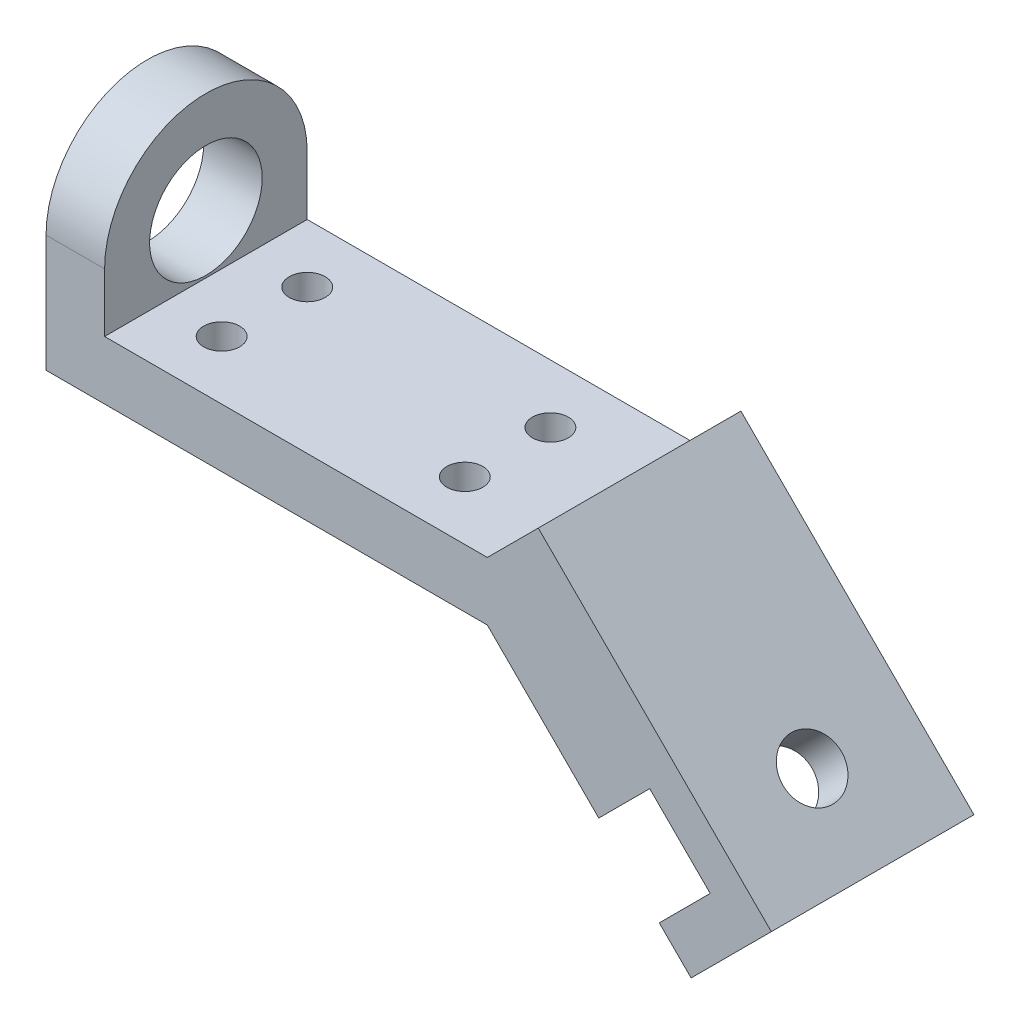
ISO-10303-21;
HEADER;
FILE_DESCRIPTION(('STEP AP214'),'2;1');
FILE_NAME('part.step','',(''),(''),'','','');
FILE_SCHEMA(('AUTOMOTIVE_DESIGN { 1 0 10303 214 1 1 1 1 }'));
ENDSEC;
DATA;
#1=APPLICATION_CONTEXT('core data for automotive mechanical design processes');
#2=APPLICATION_PROTOCOL_DEFINITION('international standard','automotive_design',2000,#1);
#3=PRODUCT_CONTEXT('',#1,'mechanical');
#4=PRODUCT('Part','Part','',(#3));
#5=PRODUCT_RELATED_PRODUCT_CATEGORY('part','',(#4));
#6=PRODUCT_DEFINITION_FORMATION('','',#4);
#7=PRODUCT_DEFINITION_CONTEXT('part definition',#1,'design');
#8=PRODUCT_DEFINITION('design','',#6,#7);
#9=PRODUCT_DEFINITION_SHAPE('','',#8);
#10=(LENGTH_UNIT() NAMED_UNIT(*) SI_UNIT(.MILLI.,.METRE.));
#11=(NAMED_UNIT(*) PLANE_ANGLE_UNIT() SI_UNIT($,.RADIAN.));
#12=(NAMED_UNIT(*) SI_UNIT($,.STERADIAN.) SOLID_ANGLE_UNIT());
#13=UNCERTAINTY_MEASURE_WITH_UNIT(LENGTH_MEASURE(1.E-05),#10,'distance_accuracy_value','');
#14=(GEOMETRIC_REPRESENTATION_CONTEXT(3) GLOBAL_UNCERTAINTY_ASSIGNED_CONTEXT((#13)) GLOBAL_UNIT_ASSIGNED_CONTEXT((#10,
#11,#12)) REPRESENTATION_CONTEXT('',''));
#15=CARTESIAN_POINT('',(0.,0.,0.));
#16=DIRECTION('',(0.,0.,1.));
#17=DIRECTION('',(1.,0.,0.));
#18=AXIS2_PLACEMENT_3D('',#15,#16,#17);
#19=CARTESIAN_POINT('',(49.,0.,22.5));
#20=DIRECTION('',(0.707106781186549,0.707106781186546,0.));
#21=DIRECTION('',(-0.707106781186546,0.707106781186549,0.));
#22=AXIS2_PLACEMENT_3D('',#19,#20,#21);
#23=PLANE('',#22);
#24=DIRECTION('',(0.707106781186546,-0.707106781186549,0.));
#25=VECTOR('',#24,1.);
#26=CARTESIAN_POINT('',(49.,0.,-22.5));
#27=LINE('',#26,#25);
#28=CARTESIAN_POINT('',(49.,0.,-22.5));
#29=VERTEX_POINT('',#28);
#30=CARTESIAN_POINT('',(73.7487373415292,-24.7487373415292,-22.5));
#31=VERTEX_POINT('',#30);
#32=EDGE_CURVE('E168',#29,#31,#27,.T.);
#33=ORIENTED_EDGE('',*,*,#32,.T.);
#34=DIRECTION('',(0.,0.,1.));
#35=VECTOR('',#34,1.);
#36=CARTESIAN_POINT('',(73.7487373415292,-24.7487373415292,-22.5));
#37=LINE('',#36,#35);
#38=CARTESIAN_POINT('',(73.7487373415292,-24.7487373415292,22.5));
#39=VERTEX_POINT('',#38);
#40=EDGE_CURVE('E225',#31,#39,#37,.T.);
#41=ORIENTED_EDGE('',*,*,#40,.T.);
#42=DIRECTION('',(0.707106781186546,-0.707106781186549,0.));
#43=VECTOR('',#42,1.);
#44=CARTESIAN_POINT('',(49.,0.,22.5));
#45=LINE('',#44,#43);
#46=CARTESIAN_POINT('',(49.,0.,22.5));
#47=VERTEX_POINT('',#46);
#48=EDGE_CURVE('E273',#47,#39,#45,.T.);
#49=ORIENTED_EDGE('',*,*,#48,.F.);
#50=DIRECTION('',(0.,0.,-1.));
#51=VECTOR('',#50,1.);
#52=CARTESIAN_POINT('',(49.,0.,22.5));
#53=LINE('',#52,#51);
#54=EDGE_CURVE('E11',#47,#29,#53,.T.);
#55=ORIENTED_EDGE('',*,*,#54,.T.);
#56=EDGE_LOOP('',(#33,#41,#49,#55));
#57=FACE_BOUND('',#56,.T.);
#58=ADVANCED_FACE('F39',(#57),#23,.F.);
#59=CARTESIAN_POINT('',(49.,13.,22.5));
#60=DIRECTION('',(0.,-1.,0.));
#61=DIRECTION('',(1.,0.,0.));
#62=AXIS2_PLACEMENT_3D('',#59,#60,#61);
#63=PLANE('',#62);
#64=CARTESIAN_POINT('',(-23.,13.,9.5));
#65=DIRECTION('',(0.,-1.,0.));
#66=DIRECTION('',(-1.,0.,0.));
#67=AXIS2_PLACEMENT_3D('',#64,#65,#66);
#68=CIRCLE('',#67,4.);
#69=CARTESIAN_POINT('',(-27.,13.,9.5));
#70=VERTEX_POINT('',#69);
#71=EDGE_CURVE('E200',#70,#70,#68,.T.);
#72=ORIENTED_EDGE('',*,*,#71,.T.);
#73=EDGE_LOOP('',(#72));
#74=FACE_BOUND('',#73,.T.);
#75=CARTESIAN_POINT('',(31.,13.,9.5));
#76=DIRECTION('',(0.,-1.,0.));
#77=DIRECTION('',(-1.,0.,0.));
#78=AXIS2_PLACEMENT_3D('',#75,#76,#77);
#79=CIRCLE('',#78,4.);
#80=CARTESIAN_POINT('',(27.,13.,9.5));
#81=VERTEX_POINT('',#80);
#82=EDGE_CURVE('E206',#81,#81,#79,.T.);
#83=ORIENTED_EDGE('',*,*,#82,.T.);
#84=EDGE_LOOP('',(#83));
#85=FACE_BOUND('',#84,.T.);
#86=CARTESIAN_POINT('',(-23.,13.,-9.5));
#87=DIRECTION('',(0.,1.,0.));
#88=DIRECTION('',(-1.,0.,0.));
#89=AXIS2_PLACEMENT_3D('',#86,#87,#88);
#90=CIRCLE('',#89,4.);
#91=CARTESIAN_POINT('',(-27.,13.,-9.5));
#92=VERTEX_POINT('',#91);
#93=EDGE_CURVE('E196',#92,#92,#90,.T.);
#94=ORIENTED_EDGE('',*,*,#93,.F.);
#95=EDGE_LOOP('',(#94));
#96=FACE_BOUND('',#95,.T.);
#97=CARTESIAN_POINT('',(31.,13.,-9.5));
#98=DIRECTION('',(0.,1.,0.));
#99=DIRECTION('',(-1.,0.,0.));
#100=AXIS2_PLACEMENT_3D('',#97,#98,#99);
#101=CIRCLE('',#100,4.);
#102=CARTESIAN_POINT('',(27.,13.,-9.5));
#103=VERTEX_POINT('',#102);
#104=EDGE_CURVE('E204',#103,#103,#101,.T.);
#105=ORIENTED_EDGE('',*,*,#104,.F.);
#106=EDGE_LOOP('',(#105));
#107=FACE_BOUND('',#106,.T.);
#108=DIRECTION('',(0.,0.,-1.));
#109=VECTOR('',#108,1.);
#110=CARTESIAN_POINT('',(-36.,13.,22.5));
#111=LINE('',#110,#109);
#112=CARTESIAN_POINT('',(-36.,13.,22.5));
#113=VERTEX_POINT('',#112);
#114=CARTESIAN_POINT('',(-36.,13.,-22.5));
#115=VERTEX_POINT('',#114);
#116=EDGE_CURVE('E254',#113,#115,#111,.T.);
#117=ORIENTED_EDGE('',*,*,#116,.F.);
#118=DIRECTION('',(-1.,0.,0.));
#119=VECTOR('',#118,1.);
#120=CARTESIAN_POINT('',(49.,13.,22.5));
#121=LINE('',#120,#119);
#122=CARTESIAN_POINT('',(49.,13.,22.5));
#123=VERTEX_POINT('',#122);
#124=EDGE_CURVE('E277',#123,#113,#121,.T.);
#125=ORIENTED_EDGE('',*,*,#124,.F.);
#126=DIRECTION('',(0.,0.,-1.));
#127=VECTOR('',#126,1.);
#128=CARTESIAN_POINT('',(49.,13.,22.5));
#129=LINE('',#128,#127);
#130=CARTESIAN_POINT('',(49.,13.,-22.5));
#131=VERTEX_POINT('',#130);
#132=EDGE_CURVE('E183',#123,#131,#129,.T.);
#133=ORIENTED_EDGE('',*,*,#132,.T.);
#134=DIRECTION('',(-1.,0.,0.));
#135=VECTOR('',#134,1.);
#136=CARTESIAN_POINT('',(49.,13.,-22.5));
#137=LINE('',#136,#135);
#138=EDGE_CURVE('E177',#131,#115,#137,.T.);
#139=ORIENTED_EDGE('',*,*,#138,.T.);
#140=EDGE_LOOP('',(#117,#125,#133,#139));
#141=FACE_BOUND('',#140,.T.);
#142=ADVANCED_FACE('F286',(#74,#85,#96,#107,#141),#63,.F.);
#143=CARTESIAN_POINT('',(-49.,0.,22.5));
#144=DIRECTION('',(0.,1.,0.));
#145=DIRECTION('',(-1.,0.,0.));
#146=AXIS2_PLACEMENT_3D('',#143,#144,#145);
#147=PLANE('',#146);
#148=CARTESIAN_POINT('',(-23.,0.,9.5));
#149=DIRECTION('',(0.,1.,0.));
#150=DIRECTION('',(-1.,0.,0.));
#151=AXIS2_PLACEMENT_3D('',#148,#149,#150);
#152=CIRCLE('',#151,4.);
#153=CARTESIAN_POINT('',(-27.,0.,9.5));
#154=VERTEX_POINT('',#153);
#155=EDGE_CURVE('E43',#154,#154,#152,.F.);
#156=ORIENTED_EDGE('',*,*,#155,.F.);
#157=EDGE_LOOP('',(#156));
#158=FACE_BOUND('',#157,.T.);
#159=CARTESIAN_POINT('',(31.,0.,9.5));
#160=DIRECTION('',(0.,1.,0.));
#161=DIRECTION('',(-1.,0.,0.));
#162=AXIS2_PLACEMENT_3D('',#159,#160,#161);
#163=CIRCLE('',#162,4.);
#164=CARTESIAN_POINT('',(27.,0.,9.5));
#165=VERTEX_POINT('',#164);
#166=EDGE_CURVE('E198',#165,#165,#163,.F.);
#167=ORIENTED_EDGE('',*,*,#166,.F.);
#168=EDGE_LOOP('',(#167));
#169=FACE_BOUND('',#168,.T.);
#170=CARTESIAN_POINT('',(-23.,0.,-9.5));
#171=DIRECTION('',(0.,1.,0.));
#172=DIRECTION('',(-1.,0.,0.));
#173=AXIS2_PLACEMENT_3D('',#170,#171,#172);
#174=CIRCLE('',#173,4.);
#175=CARTESIAN_POINT('',(-27.,0.,-9.5));
#176=VERTEX_POINT('',#175);
#177=EDGE_CURVE('E195',#176,#176,#174,.T.);
#178=ORIENTED_EDGE('',*,*,#177,.T.);
#179=EDGE_LOOP('',(#178));
#180=FACE_BOUND('',#179,.T.);
#181=CARTESIAN_POINT('',(31.,0.,-9.5));
#182=DIRECTION('',(0.,1.,0.));
#183=DIRECTION('',(-1.,0.,0.));
#184=AXIS2_PLACEMENT_3D('',#181,#182,#183);
#185=CIRCLE('',#184,4.);
#186=CARTESIAN_POINT('',(27.,0.,-9.5));
#187=VERTEX_POINT('',#186);
#188=EDGE_CURVE('E192',#187,#187,#185,.T.);
#189=ORIENTED_EDGE('',*,*,#188,.T.);
#190=EDGE_LOOP('',(#189));
#191=FACE_BOUND('',#190,.T.);
#192=DIRECTION('',(1.,0.,0.));
#193=VECTOR('',#192,1.);
#194=CARTESIAN_POINT('',(-49.,0.,-22.5));
#195=LINE('',#194,#193);
#196=CARTESIAN_POINT('',(-49.,0.,-22.5));
#197=VERTEX_POINT('',#196);
#198=EDGE_CURVE('E169',#197,#29,#195,.T.);
#199=ORIENTED_EDGE('',*,*,#198,.T.);
#200=ORIENTED_EDGE('',*,*,#54,.F.);
#201=DIRECTION('',(1.,0.,0.));
#202=VECTOR('',#201,1.);
#203=CARTESIAN_POINT('',(-49.,0.,22.5));
#204=LINE('',#203,#202);
#205=CARTESIAN_POINT('',(-49.,0.,22.5));
#206=VERTEX_POINT('',#205);
#207=EDGE_CURVE('E89',#206,#47,#204,.T.);
#208=ORIENTED_EDGE('',*,*,#207,.F.);
#209=DIRECTION('',(0.,0.,-1.));
#210=VECTOR('',#209,1.);
#211=CARTESIAN_POINT('',(-49.,0.,22.5));
#212=LINE('',#211,#210);
#213=EDGE_CURVE('E181',#206,#197,#212,.T.);
#214=ORIENTED_EDGE('',*,*,#213,.T.);
#215=EDGE_LOOP('',(#199,#200,#208,#214));
#216=FACE_BOUND('',#215,.T.);
#217=ADVANCED_FACE('F41',(#158,#169,#180,#191,#216),#147,.F.);
#218=CARTESIAN_POINT('',(87.1837661840736,-38.1837661840736,22.5));
#219=VERTEX_POINT('',#218);
#220=CARTESIAN_POINT('',(94.254833995939,-45.2548339959391,22.5));
#221=VERTEX_POINT('',#220);
#222=EDGE_CURVE('E160',#219,#221,#45,.T.);
#223=ORIENTED_EDGE('',*,*,#222,.F.);
#224=DIRECTION('',(0.,0.,1.));
#225=VECTOR('',#224,1.);
#226=CARTESIAN_POINT('',(87.1837661840736,-38.1837661840736,-22.5));
#227=LINE('',#226,#225);
#228=CARTESIAN_POINT('',(87.1837661840736,-38.1837661840736,-22.5));
#229=VERTEX_POINT('',#228);
#230=EDGE_CURVE('E147',#229,#219,#227,.T.);
#231=ORIENTED_EDGE('',*,*,#230,.F.);
#232=CARTESIAN_POINT('',(94.254833995939,-45.2548339959391,-22.5));
#233=VERTEX_POINT('',#232);
#234=EDGE_CURVE('E158',#229,#233,#27,.T.);
#235=ORIENTED_EDGE('',*,*,#234,.T.);
#236=DIRECTION('',(0.,0.,-1.));
#237=VECTOR('',#236,1.);
#238=CARTESIAN_POINT('',(94.254833995939,-45.2548339959391,22.5));
#239=LINE('',#238,#237);
#240=EDGE_CURVE('E48',#221,#233,#239,.T.);
#241=ORIENTED_EDGE('',*,*,#240,.F.);
#242=EDGE_LOOP('',(#223,#231,#235,#241));
#243=FACE_BOUND('',#242,.T.);
#244=ADVANCED_FACE('F156',(#243),#23,.F.);
#245=CARTESIAN_POINT('',(94.254833995939,-45.2548339959391,22.5));
#246=DIRECTION('',(-0.707106781186546,0.707106781186549,0.));
#247=DIRECTION('',(-0.707106781186549,-0.707106781186546,0.));
#248=AXIS2_PLACEMENT_3D('',#245,#246,#247);
#249=PLANE('',#248);
#250=DIRECTION('',(0.707106781186549,0.707106781186546,0.));
#251=VECTOR('',#250,1.);
#252=CARTESIAN_POINT('',(94.254833995939,-45.2548339959391,-22.5));
#253=LINE('',#252,#251);
#254=CARTESIAN_POINT('',(112.068542494924,-27.4411254969544,-22.5));
#255=VERTEX_POINT('',#254);
#256=EDGE_CURVE('E167',#233,#255,#253,.T.);
#257=ORIENTED_EDGE('',*,*,#256,.T.);
#258=DIRECTION('',(0.,0.,-1.));
#259=VECTOR('',#258,1.);
#260=CARTESIAN_POINT('',(112.068542494924,-27.4411254969544,-22.5));
#261=LINE('',#260,#259);
#262=CARTESIAN_POINT('',(112.068542494924,-27.4411254969544,22.5));
#263=VERTEX_POINT('',#262);
#264=EDGE_CURVE('E260',#263,#255,#261,.T.);
#265=ORIENTED_EDGE('',*,*,#264,.F.);
#266=DIRECTION('',(0.707106781186549,0.707106781186546,0.));
#267=VECTOR('',#266,1.);
#268=CARTESIAN_POINT('',(94.254833995939,-45.2548339959391,22.5));
#269=LINE('',#268,#267);
#270=EDGE_CURVE('E275',#221,#263,#269,.T.);
#271=ORIENTED_EDGE('',*,*,#270,.F.);
#272=ORIENTED_EDGE('',*,*,#240,.T.);
#273=EDGE_LOOP('',(#257,#265,#271,#272));
#274=FACE_BOUND('',#273,.T.);
#275=ADVANCED_FACE('F328',(#274),#249,.F.);
#276=CARTESIAN_POINT('',(-49.,13.,22.5));
#277=DIRECTION('',(1.,0.,0.));
#278=DIRECTION('',(0.,0.,-1.));
#279=AXIS2_PLACEMENT_3D('',#276,#277,#278);
#280=PLANE('',#279);
#281=CARTESIAN_POINT('',(-49.,26.,0.));
#282=DIRECTION('',(1.,0.,0.));
#283=DIRECTION('',(0.,0.,-1.));
#284=AXIS2_PLACEMENT_3D('',#281,#282,#283);
#285=CIRCLE('',#284,12.5);
#286=CARTESIAN_POINT('',(-49.,26.,-12.5));
#287=VERTEX_POINT('',#286);
#288=EDGE_CURVE('E152',#287,#287,#285,.T.);
#289=ORIENTED_EDGE('',*,*,#288,.T.);
#290=EDGE_LOOP('',(#289));
#291=FACE_BOUND('',#290,.T.);
#292=DIRECTION('',(0.,-1.,0.));
#293=VECTOR('',#292,1.);
#294=CARTESIAN_POINT('',(-49.,13.,-22.5));
#295=LINE('',#294,#293);
#296=CARTESIAN_POINT('',(-49.,26.,-22.5));
#297=VERTEX_POINT('',#296);
#298=EDGE_CURVE('E84',#297,#197,#295,.T.);
#299=ORIENTED_EDGE('',*,*,#298,.T.);
#300=ORIENTED_EDGE('',*,*,#213,.F.);
#301=DIRECTION('',(0.,-1.,0.));
#302=VECTOR('',#301,1.);
#303=CARTESIAN_POINT('',(-49.,13.,22.5));
#304=LINE('',#303,#302);
#305=CARTESIAN_POINT('',(-49.,26.,22.5));
#306=VERTEX_POINT('',#305);
#307=EDGE_CURVE('E65',#306,#206,#304,.T.);
#308=ORIENTED_EDGE('',*,*,#307,.F.);
#309=CARTESIAN_POINT('',(-49.,26.,0.));
#310=DIRECTION('',(-1.,0.,0.));
#311=DIRECTION('',(0.,0.,1.));
#312=AXIS2_PLACEMENT_3D('',#309,#310,#311);
#313=CIRCLE('',#312,22.5);
#314=EDGE_CURVE('E240',#306,#297,#313,.T.);
#315=ORIENTED_EDGE('',*,*,#314,.T.);
#316=EDGE_LOOP('',(#299,#300,#308,#315));
#317=FACE_BOUND('',#316,.T.);
#318=ADVANCED_FACE('F298',(#291,#317),#280,.F.);
#319=CARTESIAN_POINT('',(0.,0.,22.5));
#320=DIRECTION('',(0.,0.,-1.));
#321=DIRECTION('',(-1.,0.,0.));
#322=AXIS2_PLACEMENT_3D('',#319,#320,#321);
#323=PLANE('',#322);
#324=ORIENTED_EDGE('',*,*,#48,.T.);
#325=DIRECTION('',(0.707106781186547,0.707106781186548,0.));
#326=VECTOR('',#325,1.);
#327=CARTESIAN_POINT('',(49.2487373415292,-49.2487373415292,22.5));
#328=LINE('',#327,#326);
#329=CARTESIAN_POINT('',(85.0624458405139,-13.4350288425444,22.5));
#330=VERTEX_POINT('',#329);
#331=EDGE_CURVE('E237',#39,#330,#328,.T.);
#332=ORIENTED_EDGE('',*,*,#331,.T.);
#333=DIRECTION('',(0.707106781186548,-0.707106781186547,0.));
#334=VECTOR('',#333,1.);
#335=CARTESIAN_POINT('',(35.8137084989848,35.8137084989848,22.5));
#336=LINE('',#335,#334);
#337=CARTESIAN_POINT('',(98.4974746830583,-26.8700576850888,22.5));
#338=VERTEX_POINT('',#337);
#339=EDGE_CURVE('E234',#330,#338,#336,.T.);
#340=ORIENTED_EDGE('',*,*,#339,.T.);
#341=DIRECTION('',(-0.707106781186547,-0.707106781186548,0.));
#342=VECTOR('',#341,1.);
#343=CARTESIAN_POINT('',(62.6837661840736,-62.6837661840735,22.5));
#344=LINE('',#343,#342);
#345=EDGE_CURVE('E228',#338,#219,#344,.T.);
#346=ORIENTED_EDGE('',*,*,#345,.T.);
#347=ORIENTED_EDGE('',*,*,#222,.T.);
#348=ORIENTED_EDGE('',*,*,#270,.T.);
#349=DIRECTION('',(0.707106781186547,-0.707106781186548,0.));
#350=VECTOR('',#349,1.);
#351=CARTESIAN_POINT('',(112.068542494924,-27.4411254969544,22.5));
#352=LINE('',#351,#350);
#353=CARTESIAN_POINT('',(60.3137084989848,24.3137084989847,22.5));
#354=VERTEX_POINT('',#353);
#355=EDGE_CURVE('E257',#354,#263,#352,.T.);
#356=ORIENTED_EDGE('',*,*,#355,.F.);
#357=DIRECTION('',(-0.707106781186548,-0.707106781186547,0.));
#358=VECTOR('',#357,1.);
#359=CARTESIAN_POINT('',(60.3137084989848,24.3137084989847,22.5));
#360=LINE('',#359,#358);
#361=EDGE_CURVE('E267',#354,#123,#360,.T.);
#362=ORIENTED_EDGE('',*,*,#361,.T.);
#363=ORIENTED_EDGE('',*,*,#124,.T.);
#364=DIRECTION('',(0.,1.,0.));
#365=VECTOR('',#364,1.);
#366=CARTESIAN_POINT('',(-36.,0.,22.5));
#367=LINE('',#366,#365);
#368=CARTESIAN_POINT('',(-36.,26.,22.5));
#369=VERTEX_POINT('',#368);
#370=EDGE_CURVE('E241',#113,#369,#367,.T.);
#371=ORIENTED_EDGE('',*,*,#370,.T.);
#372=DIRECTION('',(-1.,0.,0.));
#373=VECTOR('',#372,1.);
#374=CARTESIAN_POINT('',(-36.,26.,22.5));
#375=LINE('',#374,#373);
#376=EDGE_CURVE('E249',#369,#306,#375,.T.);
#377=ORIENTED_EDGE('',*,*,#376,.T.);
#378=ORIENTED_EDGE('',*,*,#307,.T.);
#379=ORIENTED_EDGE('',*,*,#207,.T.);
#380=EDGE_LOOP('',(#324,#332,#340,#346,#347,#348,#356,#362,#363,#371,#377,#378,#379));
#381=FACE_BOUND('',#380,.T.);
#382=ADVANCED_FACE('F279',(#381),#323,.F.);
#383=CARTESIAN_POINT('',(0.,0.,-22.5));
#384=DIRECTION('',(0.,0.,-1.));
#385=DIRECTION('',(-1.,0.,0.));
#386=AXIS2_PLACEMENT_3D('',#383,#384,#385);
#387=PLANE('',#386);
#388=DIRECTION('',(-0.707106781186547,-0.707106781186548,0.));
#389=VECTOR('',#388,1.);
#390=CARTESIAN_POINT('',(73.7487373415292,-24.7487373415292,-22.5));
#391=LINE('',#390,#389);
#392=CARTESIAN_POINT('',(85.0624458405139,-13.4350288425444,-22.5));
#393=VERTEX_POINT('',#392);
#394=EDGE_CURVE('E161',#393,#31,#391,.T.);
#395=ORIENTED_EDGE('',*,*,#394,.T.);
#396=ORIENTED_EDGE('',*,*,#32,.F.);
#397=ORIENTED_EDGE('',*,*,#198,.F.);
#398=ORIENTED_EDGE('',*,*,#298,.F.);
#399=DIRECTION('',(-1.,0.,0.));
#400=VECTOR('',#399,1.);
#401=CARTESIAN_POINT('',(-36.,26.,-22.5));
#402=LINE('',#401,#400);
#403=CARTESIAN_POINT('',(-36.,26.,-22.5));
#404=VERTEX_POINT('',#403);
#405=EDGE_CURVE('E251',#404,#297,#402,.T.);
#406=ORIENTED_EDGE('',*,*,#405,.F.);
#407=DIRECTION('',(0.,-1.,0.));
#408=VECTOR('',#407,1.);
#409=CARTESIAN_POINT('',(-36.,0.,-22.5));
#410=LINE('',#409,#408);
#411=EDGE_CURVE('E246',#404,#115,#410,.T.);
#412=ORIENTED_EDGE('',*,*,#411,.T.);
#413=ORIENTED_EDGE('',*,*,#138,.F.);
#414=DIRECTION('',(-0.707106781186548,-0.707106781186547,0.));
#415=VECTOR('',#414,1.);
#416=CARTESIAN_POINT('',(60.3137084989848,24.3137084989847,-22.5));
#417=LINE('',#416,#415);
#418=CARTESIAN_POINT('',(60.3137084989848,24.3137084989847,-22.5));
#419=VERTEX_POINT('',#418);
#420=EDGE_CURVE('E172',#419,#131,#417,.T.);
#421=ORIENTED_EDGE('',*,*,#420,.F.);
#422=DIRECTION('',(-0.707106781186547,0.707106781186548,0.));
#423=VECTOR('',#422,1.);
#424=CARTESIAN_POINT('',(60.3137084989848,24.3137084989847,-22.5));
#425=LINE('',#424,#423);
#426=EDGE_CURVE('E263',#255,#419,#425,.T.);
#427=ORIENTED_EDGE('',*,*,#426,.F.);
#428=ORIENTED_EDGE('',*,*,#256,.F.);
#429=ORIENTED_EDGE('',*,*,#234,.F.);
#430=DIRECTION('',(0.707106781186547,0.707106781186548,0.));
#431=VECTOR('',#430,1.);
#432=CARTESIAN_POINT('',(98.4974746830583,-26.8700576850888,-22.5));
#433=LINE('',#432,#431);
#434=CARTESIAN_POINT('',(98.4974746830583,-26.8700576850888,-22.5));
#435=VERTEX_POINT('',#434);
#436=EDGE_CURVE('E144',#229,#435,#433,.T.);
#437=ORIENTED_EDGE('',*,*,#436,.T.);
#438=DIRECTION('',(-0.707106781186548,0.707106781186547,0.));
#439=VECTOR('',#438,1.);
#440=CARTESIAN_POINT('',(85.0624458405139,-13.4350288425444,-22.5));
#441=LINE('',#440,#439);
#442=EDGE_CURVE('E56',#435,#393,#441,.T.);
#443=ORIENTED_EDGE('',*,*,#442,.T.);
#444=EDGE_LOOP('',(#395,#396,#397,#398,#406,#412,#413,#421,#427,#428,#429,#437,#443));
#445=FACE_BOUND('',#444,.T.);
#446=ADVANCED_FACE('F165',(#445),#387,.T.);
#447=CARTESIAN_POINT('',(60.3137084989848,24.3137084989847,22.5));
#448=DIRECTION('',(0.707106781186547,-0.707106781186548,0.));
#449=DIRECTION('',(0.707106781186548,0.707106781186547,0.));
#450=AXIS2_PLACEMENT_3D('',#447,#448,#449);
#451=PLANE('',#450);
#452=ORIENTED_EDGE('',*,*,#132,.F.);
#453=ORIENTED_EDGE('',*,*,#361,.F.);
#454=DIRECTION('',(0.,0.,1.));
#455=VECTOR('',#454,1.);
#456=CARTESIAN_POINT('',(60.3137084989848,24.3137084989847,22.5));
#457=LINE('',#456,#455);
#458=EDGE_CURVE('E265',#419,#354,#457,.T.);
#459=ORIENTED_EDGE('',*,*,#458,.F.);
#460=ORIENTED_EDGE('',*,*,#420,.T.);
#461=EDGE_LOOP('',(#452,#453,#459,#460));
#462=FACE_BOUND('',#461,.T.);
#463=ADVANCED_FACE('F288',(#462),#451,.F.);
#464=CARTESIAN_POINT('',(42.3137084989848,42.3137084989847,0.));
#465=DIRECTION('',(-0.707106781186548,-0.707106781186547,0.));
#466=DIRECTION('',(0.707106781186547,-0.707106781186548,0.));
#467=AXIS2_PLACEMENT_3D('',#464,#465,#466);
#468=PLANE('',#467);
#469=CARTESIAN_POINT('',(98.6335136523794,-14.00609665441,0.));
#470=DIRECTION('',(0.707106781186548,0.707106781186547,0.));
#471=DIRECTION('',(-0.707106781186547,0.707106781186548,0.));
#472=AXIS2_PLACEMENT_3D('',#469,#470,#471);
#473=CIRCLE('',#472,6.5);
#474=CARTESIAN_POINT('',(94.0373195746668,-9.40990257669739,0.));
#475=VERTEX_POINT('',#474);
#476=EDGE_CURVE('E191',#475,#475,#473,.T.);
#477=ORIENTED_EDGE('',*,*,#476,.F.);
#478=EDGE_LOOP('',(#477));
#479=FACE_BOUND('',#478,.T.);
#480=ORIENTED_EDGE('',*,*,#355,.T.);
#481=ORIENTED_EDGE('',*,*,#264,.T.);
#482=ORIENTED_EDGE('',*,*,#426,.T.);
#483=ORIENTED_EDGE('',*,*,#458,.T.);
#484=EDGE_LOOP('',(#480,#481,#482,#483));
#485=FACE_BOUND('',#484,.T.);
#486=ADVANCED_FACE('F372',(#479,#485),#468,.F.);
#487=CARTESIAN_POINT('',(-36.,26.,0.));
#488=DIRECTION('',(-1.,0.,0.));
#489=DIRECTION('',(0.,0.,1.));
#490=AXIS2_PLACEMENT_3D('',#487,#488,#489);
#491=PLANE('',#490);
#492=CARTESIAN_POINT('',(-36.,26.,0.));
#493=DIRECTION('',(1.,0.,0.));
#494=DIRECTION('',(0.,0.,-1.));
#495=AXIS2_PLACEMENT_3D('',#492,#493,#494);
#496=CIRCLE('',#495,12.5);
#497=CARTESIAN_POINT('',(-36.,26.,-12.5));
#498=VERTEX_POINT('',#497);
#499=EDGE_CURVE('E190',#498,#498,#496,.T.);
#500=ORIENTED_EDGE('',*,*,#499,.F.);
#501=EDGE_LOOP('',(#500));
#502=FACE_BOUND('',#501,.T.);
#503=ORIENTED_EDGE('',*,*,#370,.F.);
#504=ORIENTED_EDGE('',*,*,#116,.T.);
#505=ORIENTED_EDGE('',*,*,#411,.F.);
#506=CARTESIAN_POINT('',(-36.,26.,0.));
#507=DIRECTION('',(-1.,0.,0.));
#508=DIRECTION('',(0.,0.,1.));
#509=AXIS2_PLACEMENT_3D('',#506,#507,#508);
#510=CIRCLE('',#509,22.5);
#511=EDGE_CURVE('E243',#369,#404,#510,.T.);
#512=ORIENTED_EDGE('',*,*,#511,.F.);
#513=EDGE_LOOP('',(#503,#504,#505,#512));
#514=FACE_BOUND('',#513,.T.);
#515=ADVANCED_FACE('F294',(#502,#514),#491,.F.);
#516=CARTESIAN_POINT('',(-36.,26.,0.));
#517=DIRECTION('',(-1.,0.,0.));
#518=DIRECTION('',(0.,0.,1.));
#519=AXIS2_PLACEMENT_3D('',#516,#517,#518);
#520=CYLINDRICAL_SURFACE('',#519,22.5);
#521=ORIENTED_EDGE('',*,*,#314,.F.);
#522=ORIENTED_EDGE('',*,*,#376,.F.);
#523=ORIENTED_EDGE('',*,*,#511,.T.);
#524=ORIENTED_EDGE('',*,*,#405,.T.);
#525=EDGE_LOOP('',(#521,#522,#523,#524));
#526=FACE_BOUND('',#525,.T.);
#527=ADVANCED_FACE('F297',(#526),#520,.T.);
#528=CARTESIAN_POINT('',(73.7487373415292,-24.7487373415292,-22.5));
#529=DIRECTION('',(-0.707106781186548,0.707106781186547,0.));
#530=DIRECTION('',(-0.707106781186547,-0.707106781186548,0.));
#531=AXIS2_PLACEMENT_3D('',#528,#529,#530);
#532=PLANE('',#531);
#533=ORIENTED_EDGE('',*,*,#40,.F.);
#534=ORIENTED_EDGE('',*,*,#394,.F.);
#535=DIRECTION('',(0.,0.,1.));
#536=VECTOR('',#535,1.);
#537=CARTESIAN_POINT('',(85.0624458405139,-13.4350288425444,-22.5));
#538=LINE('',#537,#536);
#539=EDGE_CURVE('E229',#393,#330,#538,.T.);
#540=ORIENTED_EDGE('',*,*,#539,.T.);
#541=ORIENTED_EDGE('',*,*,#331,.F.);
#542=EDGE_LOOP('',(#533,#534,#540,#541));
#543=FACE_BOUND('',#542,.T.);
#544=ADVANCED_FACE('F305',(#543),#532,.F.);
#545=CARTESIAN_POINT('',(85.0624458405139,-13.4350288425444,-22.5));
#546=DIRECTION('',(0.707106781186547,0.707106781186548,0.));
#547=DIRECTION('',(-0.707106781186548,0.707106781186547,0.));
#548=AXIS2_PLACEMENT_3D('',#545,#546,#547);
#549=PLANE('',#548);
#550=CARTESIAN_POINT('',(92.1335136523794,-20.5060966544099,0.));
#551=DIRECTION('',(0.707106781186547,0.707106781186548,0.));
#552=DIRECTION('',(-0.707106781186548,0.707106781186547,0.));
#553=AXIS2_PLACEMENT_3D('',#550,#551,#552);
#554=CIRCLE('',#553,6.5);
#555=CARTESIAN_POINT('',(87.5373195746669,-15.9099025766973,0.));
#556=VERTEX_POINT('',#555);
#557=EDGE_CURVE('E187',#556,#556,#554,.T.);
#558=ORIENTED_EDGE('',*,*,#557,.T.);
#559=EDGE_LOOP('',(#558));
#560=FACE_BOUND('',#559,.T.);
#561=ORIENTED_EDGE('',*,*,#539,.F.);
#562=ORIENTED_EDGE('',*,*,#442,.F.);
#563=DIRECTION('',(0.,0.,1.));
#564=VECTOR('',#563,1.);
#565=CARTESIAN_POINT('',(98.4974746830583,-26.8700576850888,-22.5));
#566=LINE('',#565,#564);
#567=EDGE_CURVE('E149',#435,#338,#566,.T.);
#568=ORIENTED_EDGE('',*,*,#567,.T.);
#569=ORIENTED_EDGE('',*,*,#339,.F.);
#570=EDGE_LOOP('',(#561,#562,#568,#569));
#571=FACE_BOUND('',#570,.T.);
#572=ADVANCED_FACE('F307',(#560,#571),#549,.F.);
#573=CARTESIAN_POINT('',(98.4974746830583,-26.8700576850888,-22.5));
#574=DIRECTION('',(0.707106781186548,-0.707106781186547,0.));
#575=DIRECTION('',(0.707106781186547,0.707106781186548,0.));
#576=AXIS2_PLACEMENT_3D('',#573,#574,#575);
#577=PLANE('',#576);
#578=ORIENTED_EDGE('',*,*,#567,.F.);
#579=ORIENTED_EDGE('',*,*,#436,.F.);
#580=ORIENTED_EDGE('',*,*,#230,.T.);
#581=ORIENTED_EDGE('',*,*,#345,.F.);
#582=EDGE_LOOP('',(#578,#579,#580,#581));
#583=FACE_BOUND('',#582,.T.);
#584=ADVANCED_FACE('F146',(#583),#577,.F.);
#585=CARTESIAN_POINT('',(-49.,26.,0.));
#586=DIRECTION('',(1.,0.,0.));
#587=DIRECTION('',(0.,0.,-1.));
#588=AXIS2_PLACEMENT_3D('',#585,#586,#587);
#589=CYLINDRICAL_SURFACE('',#588,12.5);
#590=ORIENTED_EDGE('',*,*,#288,.F.);
#591=EDGE_LOOP('',(#590));
#592=FACE_BOUND('',#591,.T.);
#593=ORIENTED_EDGE('',*,*,#499,.T.);
#594=EDGE_LOOP('',(#593));
#595=FACE_BOUND('',#594,.T.);
#596=ADVANCED_FACE('F316',(#592,#595),#589,.F.);
#597=CARTESIAN_POINT('',(9.19238815542493,-103.447222151364,0.));
#598=DIRECTION('',(0.707106781186548,0.707106781186547,0.));
#599=DIRECTION('',(-0.707106781186547,0.707106781186548,0.));
#600=AXIS2_PLACEMENT_3D('',#597,#598,#599);
#601=CYLINDRICAL_SURFACE('',#600,6.5);
#602=ORIENTED_EDGE('',*,*,#476,.T.);
#603=EDGE_LOOP('',(#602));
#604=FACE_BOUND('',#603,.T.);
#605=ORIENTED_EDGE('',*,*,#557,.F.);
#606=EDGE_LOOP('',(#605));
#607=FACE_BOUND('',#606,.T.);
#608=ADVANCED_FACE('F349',(#604,#607),#601,.F.);
#609=CARTESIAN_POINT('',(31.,-45.2548339959391,-9.5));
#610=DIRECTION('',(0.,1.,0.));
#611=DIRECTION('',(-1.,0.,0.));
#612=AXIS2_PLACEMENT_3D('',#609,#610,#611);
#613=CYLINDRICAL_SURFACE('',#612,4.);
#614=ORIENTED_EDGE('',*,*,#104,.T.);
#615=EDGE_LOOP('',(#614));
#616=FACE_BOUND('',#615,.T.);
#617=ORIENTED_EDGE('',*,*,#188,.F.);
#618=EDGE_LOOP('',(#617));
#619=FACE_BOUND('',#618,.T.);
#620=ADVANCED_FACE('F346',(#616,#619),#613,.F.);
#621=CARTESIAN_POINT('',(-23.,-45.2548339959391,-9.5));
#622=DIRECTION('',(0.,1.,0.));
#623=DIRECTION('',(-1.,0.,0.));
#624=AXIS2_PLACEMENT_3D('',#621,#622,#623);
#625=CYLINDRICAL_SURFACE('',#624,4.);
#626=ORIENTED_EDGE('',*,*,#93,.T.);
#627=EDGE_LOOP('',(#626));
#628=FACE_BOUND('',#627,.T.);
#629=ORIENTED_EDGE('',*,*,#177,.F.);
#630=EDGE_LOOP('',(#629));
#631=FACE_BOUND('',#630,.T.);
#632=ADVANCED_FACE('F348',(#628,#631),#625,.F.);
#633=CARTESIAN_POINT('',(31.,-45.2548339959391,9.5));
#634=DIRECTION('',(0.,1.,0.));
#635=DIRECTION('',(-1.,0.,0.));
#636=AXIS2_PLACEMENT_3D('',#633,#634,#635);
#637=CYLINDRICAL_SURFACE('',#636,4.);
#638=ORIENTED_EDGE('',*,*,#82,.F.);
#639=EDGE_LOOP('',(#638));
#640=FACE_BOUND('',#639,.T.);
#641=ORIENTED_EDGE('',*,*,#166,.T.);
#642=EDGE_LOOP('',(#641));
#643=FACE_BOUND('',#642,.T.);
#644=ADVANCED_FACE('F356',(#640,#643),#637,.F.);
#645=CARTESIAN_POINT('',(-23.,-45.2548339959391,9.5));
#646=DIRECTION('',(0.,1.,0.));
#647=DIRECTION('',(-1.,0.,0.));
#648=AXIS2_PLACEMENT_3D('',#645,#646,#647);
#649=CYLINDRICAL_SURFACE('',#648,4.);
#650=ORIENTED_EDGE('',*,*,#71,.F.);
#651=EDGE_LOOP('',(#650));
#652=FACE_BOUND('',#651,.T.);
#653=ORIENTED_EDGE('',*,*,#155,.T.);
#654=EDGE_LOOP('',(#653));
#655=FACE_BOUND('',#654,.T.);
#656=ADVANCED_FACE('F486',(#652,#655),#649,.F.);
#657=CLOSED_SHELL('',(#58,#142,#217,#244,#275,#318,#382,#446,#463,#486,#515,#527,#544,#572,#584,
#596,#608,#620,#632,#644,#656));
#658=MANIFOLD_SOLID_BREP('B2',#657);
#659=ADVANCED_BREP_SHAPE_REPRESENTATION('',(#18,#658),#14);
#660=SHAPE_DEFINITION_REPRESENTATION(#9,#659);
ENDSEC;
END-ISO-10303-21;
